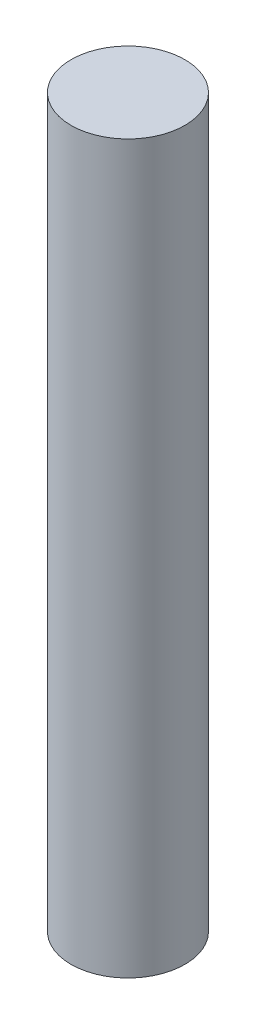
ISO-10303-21;
HEADER;
FILE_DESCRIPTION(('STEP AP214'),'2;1');
FILE_NAME('part.step','',(''),(''),'','','');
FILE_SCHEMA(('AUTOMOTIVE_DESIGN { 1 0 10303 214 1 1 1 1 }'));
ENDSEC;
DATA;
#1=APPLICATION_CONTEXT('core data for automotive mechanical design processes');
#2=APPLICATION_PROTOCOL_DEFINITION('international standard','automotive_design',2000,#1);
#3=PRODUCT_CONTEXT('',#1,'mechanical');
#4=PRODUCT('Part','Part','',(#3));
#5=PRODUCT_RELATED_PRODUCT_CATEGORY('part','',(#4));
#6=PRODUCT_DEFINITION_FORMATION('','',#4);
#7=PRODUCT_DEFINITION_CONTEXT('part definition',#1,'design');
#8=PRODUCT_DEFINITION('design','',#6,#7);
#9=PRODUCT_DEFINITION_SHAPE('','',#8);
#10=(LENGTH_UNIT() NAMED_UNIT(*) SI_UNIT(.MILLI.,.METRE.));
#11=(NAMED_UNIT(*) PLANE_ANGLE_UNIT() SI_UNIT($,.RADIAN.));
#12=(NAMED_UNIT(*) SI_UNIT($,.STERADIAN.) SOLID_ANGLE_UNIT());
#13=UNCERTAINTY_MEASURE_WITH_UNIT(LENGTH_MEASURE(1.E-05),#10,'distance_accuracy_value','');
#14=(GEOMETRIC_REPRESENTATION_CONTEXT(3) GLOBAL_UNCERTAINTY_ASSIGNED_CONTEXT((#13)) GLOBAL_UNIT_ASSIGNED_CONTEXT((#10,
#11,#12)) REPRESENTATION_CONTEXT('',''));
#15=CARTESIAN_POINT('',(0.,0.,0.));
#16=DIRECTION('',(0.,0.,1.));
#17=DIRECTION('',(1.,0.,0.));
#18=AXIS2_PLACEMENT_3D('',#15,#16,#17);
#19=CARTESIAN_POINT('',(0.,185.,0.));
#20=DIRECTION('',(0.,-1.,0.));
#21=DIRECTION('',(0.,0.,-1.));
#22=AXIS2_PLACEMENT_3D('',#19,#20,#21);
#23=CYLINDRICAL_SURFACE('',#22,14.5);
#24=CARTESIAN_POINT('',(0.,185.,0.));
#25=DIRECTION('',(0.,1.,0.));
#26=DIRECTION('',(0.,0.,1.));
#27=AXIS2_PLACEMENT_3D('',#24,#25,#26);
#28=CIRCLE('',#27,14.5);
#29=CARTESIAN_POINT('',(0.,185.,14.5));
#30=VERTEX_POINT('',#29);
#31=EDGE_CURVE('E10',#30,#30,#28,.T.);
#32=ORIENTED_EDGE('',*,*,#31,.F.);
#33=EDGE_LOOP('',(#32));
#34=FACE_BOUND('',#33,.T.);
#35=CARTESIAN_POINT('',(0.,0.,0.));
#36=DIRECTION('',(0.,1.,0.));
#37=DIRECTION('',(0.,0.,1.));
#38=AXIS2_PLACEMENT_3D('',#35,#36,#37);
#39=CIRCLE('',#38,14.5);
#40=CARTESIAN_POINT('',(0.,0.,14.5));
#41=VERTEX_POINT('',#40);
#42=EDGE_CURVE('E44',#41,#41,#39,.T.);
#43=ORIENTED_EDGE('',*,*,#42,.T.);
#44=EDGE_LOOP('',(#43));
#45=FACE_BOUND('',#44,.T.);
#46=ADVANCED_FACE('F41',(#34,#45),#23,.T.);
#47=CARTESIAN_POINT('',(0.,185.,0.));
#48=DIRECTION('',(0.,1.,0.));
#49=DIRECTION('',(0.,0.,1.));
#50=AXIS2_PLACEMENT_3D('',#47,#48,#49);
#51=PLANE('',#50);
#52=ORIENTED_EDGE('',*,*,#31,.T.);
#53=EDGE_LOOP('',(#52));
#54=FACE_BOUND('',#53,.T.);
#55=ADVANCED_FACE('F58',(#54),#51,.T.);
#56=CARTESIAN_POINT('',(0.,0.,0.));
#57=DIRECTION('',(0.,1.,0.));
#58=DIRECTION('',(0.,0.,1.));
#59=AXIS2_PLACEMENT_3D('',#56,#57,#58);
#60=PLANE('',#59);
#61=ORIENTED_EDGE('',*,*,#42,.F.);
#62=EDGE_LOOP('',(#61));
#63=FACE_BOUND('',#62,.T.);
#64=ADVANCED_FACE('F56',(#63),#60,.F.);
#65=CLOSED_SHELL('',(#46,#55,#64));
#66=MANIFOLD_SOLID_BREP('B2',#65);
#67=ADVANCED_BREP_SHAPE_REPRESENTATION('',(#18,#66),#14);
#68=SHAPE_DEFINITION_REPRESENTATION(#9,#67);
ENDSEC;
END-ISO-10303-21;
